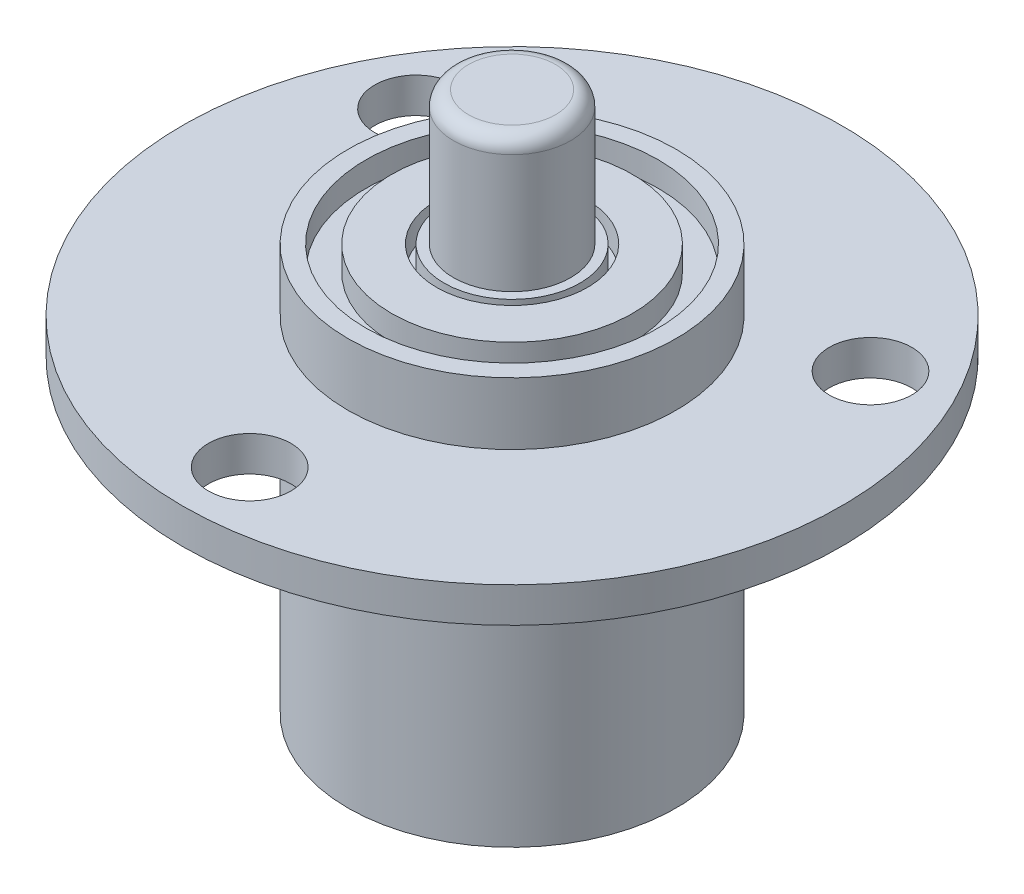
ISO-10303-21;
HEADER;
FILE_DESCRIPTION(('STEP AP214'),'2;1');
FILE_NAME('part.step','',(''),(''),'','','');
FILE_SCHEMA(('AUTOMOTIVE_DESIGN { 1 0 10303 214 1 1 1 1 }'));
ENDSEC;
DATA;
#1=APPLICATION_CONTEXT('core data for automotive mechanical design processes');
#2=APPLICATION_PROTOCOL_DEFINITION('international standard','automotive_design',2000,#1);
#3=PRODUCT_CONTEXT('',#1,'mechanical');
#4=PRODUCT('Part','Part','',(#3));
#5=PRODUCT_RELATED_PRODUCT_CATEGORY('part','',(#4));
#6=PRODUCT_DEFINITION_FORMATION('','',#4);
#7=PRODUCT_DEFINITION_CONTEXT('part definition',#1,'design');
#8=PRODUCT_DEFINITION('design','',#6,#7);
#9=PRODUCT_DEFINITION_SHAPE('','',#8);
#10=(LENGTH_UNIT() NAMED_UNIT(*) SI_UNIT(.MILLI.,.METRE.));
#11=(NAMED_UNIT(*) PLANE_ANGLE_UNIT() SI_UNIT($,.RADIAN.));
#12=(NAMED_UNIT(*) SI_UNIT($,.STERADIAN.) SOLID_ANGLE_UNIT());
#13=UNCERTAINTY_MEASURE_WITH_UNIT(LENGTH_MEASURE(1.E-05),#10,'distance_accuracy_value','');
#14=(GEOMETRIC_REPRESENTATION_CONTEXT(3) GLOBAL_UNCERTAINTY_ASSIGNED_CONTEXT((#13)) GLOBAL_UNIT_ASSIGNED_CONTEXT((#10,
#11,#12)) REPRESENTATION_CONTEXT('',''));
#15=CARTESIAN_POINT('',(0.,0.,0.));
#16=DIRECTION('',(0.,0.,1.));
#17=DIRECTION('',(1.,0.,0.));
#18=AXIS2_PLACEMENT_3D('',#15,#16,#17);
#19=CARTESIAN_POINT('',(0.,2.34,0.));
#20=DIRECTION('',(0.,-1.,0.));
#21=DIRECTION('',(0.,0.,-1.));
#22=AXIS2_PLACEMENT_3D('',#19,#20,#21);
#23=CYLINDRICAL_SURFACE('',#22,21.95);
#24=CARTESIAN_POINT('',(0.,2.34,0.));
#25=DIRECTION('',(0.,1.,0.));
#26=DIRECTION('',(0.,0.,1.));
#27=AXIS2_PLACEMENT_3D('',#24,#25,#26);
#28=CIRCLE('',#27,21.95);
#29=CARTESIAN_POINT('',(0.,2.34,21.95));
#30=VERTEX_POINT('',#29);
#31=EDGE_CURVE('E81',#30,#30,#28,.T.);
#32=ORIENTED_EDGE('',*,*,#31,.F.);
#33=EDGE_LOOP('',(#32));
#34=FACE_BOUND('',#33,.T.);
#35=CARTESIAN_POINT('',(0.,0.,0.));
#36=DIRECTION('',(0.,1.,0.));
#37=DIRECTION('',(0.,0.,1.));
#38=AXIS2_PLACEMENT_3D('',#35,#36,#37);
#39=CIRCLE('',#38,21.95);
#40=CARTESIAN_POINT('',(0.,0.,21.95));
#41=VERTEX_POINT('',#40);
#42=EDGE_CURVE('E76',#41,#41,#39,.T.);
#43=ORIENTED_EDGE('',*,*,#42,.T.);
#44=EDGE_LOOP('',(#43));
#45=FACE_BOUND('',#44,.T.);
#46=ADVANCED_FACE('F51',(#34,#45),#23,.T.);
#47=CARTESIAN_POINT('',(0.,2.34,0.));
#48=DIRECTION('',(0.,1.,0.));
#49=DIRECTION('',(0.,0.,1.));
#50=AXIS2_PLACEMENT_3D('',#47,#48,#49);
#51=PLANE('',#50);
#52=CARTESIAN_POINT('',(-15.133793931133,2.34,-8.73750000000007));
#53=DIRECTION('',(0.,1.,0.));
#54=DIRECTION('',(0.,0.,1.));
#55=AXIS2_PLACEMENT_3D('',#52,#53,#54);
#56=CIRCLE('',#55,2.75);
#57=CARTESIAN_POINT('',(-15.133793931133,2.34,-5.98750000000007));
#58=VERTEX_POINT('',#57);
#59=EDGE_CURVE('E103',#58,#58,#56,.T.);
#60=ORIENTED_EDGE('',*,*,#59,.F.);
#61=EDGE_LOOP('',(#60));
#62=FACE_BOUND('',#61,.T.);
#63=CARTESIAN_POINT('',(15.1337939311331,2.34,-8.73749999999986));
#64=DIRECTION('',(0.,1.,0.));
#65=DIRECTION('',(0.,0.,1.));
#66=AXIS2_PLACEMENT_3D('',#63,#64,#65);
#67=CIRCLE('',#66,2.75);
#68=CARTESIAN_POINT('',(15.1337939311331,2.34,-5.98749999999986));
#69=VERTEX_POINT('',#68);
#70=EDGE_CURVE('E107',#69,#69,#67,.T.);
#71=ORIENTED_EDGE('',*,*,#70,.F.);
#72=EDGE_LOOP('',(#71));
#73=FACE_BOUND('',#72,.T.);
#74=CARTESIAN_POINT('',(0.,2.34,17.475));
#75=DIRECTION('',(0.,1.,0.));
#76=DIRECTION('',(0.,0.,1.));
#77=AXIS2_PLACEMENT_3D('',#74,#75,#76);
#78=CIRCLE('',#77,2.75);
#79=CARTESIAN_POINT('',(0.,2.34,20.225));
#80=VERTEX_POINT('',#79);
#81=EDGE_CURVE('E95',#80,#80,#78,.T.);
#82=ORIENTED_EDGE('',*,*,#81,.F.);
#83=EDGE_LOOP('',(#82));
#84=FACE_BOUND('',#83,.T.);
#85=CARTESIAN_POINT('',(0.,2.33999999999999,0.));
#86=DIRECTION('',(0.,1.,0.));
#87=DIRECTION('',(0.,0.,1.));
#88=AXIS2_PLACEMENT_3D('',#85,#86,#87);
#89=CIRCLE('',#88,10.925);
#90=CARTESIAN_POINT('',(0.,2.33999999999999,10.925));
#91=VERTEX_POINT('',#90);
#92=EDGE_CURVE('E69',#91,#91,#89,.T.);
#93=ORIENTED_EDGE('',*,*,#92,.F.);
#94=EDGE_LOOP('',(#93));
#95=FACE_BOUND('',#94,.T.);
#96=ORIENTED_EDGE('',*,*,#31,.T.);
#97=EDGE_LOOP('',(#96));
#98=FACE_BOUND('',#97,.T.);
#99=ADVANCED_FACE('F192',(#62,#73,#84,#95,#98),#51,.T.);
#100=CARTESIAN_POINT('',(0.,0.,0.));
#101=DIRECTION('',(0.,1.,0.));
#102=DIRECTION('',(0.,0.,1.));
#103=AXIS2_PLACEMENT_3D('',#100,#101,#102);
#104=PLANE('',#103);
#105=CARTESIAN_POINT('',(-15.133793931133,0.,-8.73750000000007));
#106=DIRECTION('',(0.,-1.,0.));
#107=DIRECTION('',(0.866025403784436,0.,0.500000000000004));
#108=AXIS2_PLACEMENT_3D('',#105,#106,#107);
#109=CIRCLE('',#108,2.75);
#110=CARTESIAN_POINT('',(-12.7522240707258,0.,-7.36250000000006));
#111=VERTEX_POINT('',#110);
#112=EDGE_CURVE('E111',#111,#111,#109,.T.);
#113=ORIENTED_EDGE('',*,*,#112,.F.);
#114=EDGE_LOOP('',(#113));
#115=FACE_BOUND('',#114,.T.);
#116=CARTESIAN_POINT('',(15.1337939311331,0.,-8.73749999999986));
#117=DIRECTION('',(0.,-1.,0.));
#118=DIRECTION('',(-0.866025403784443,0.,0.499999999999992));
#119=AXIS2_PLACEMENT_3D('',#116,#117,#118);
#120=CIRCLE('',#119,2.75);
#121=CARTESIAN_POINT('',(12.7522240707259,0.,-7.36249999999988));
#122=VERTEX_POINT('',#121);
#123=EDGE_CURVE('E112',#122,#122,#120,.T.);
#124=ORIENTED_EDGE('',*,*,#123,.F.);
#125=EDGE_LOOP('',(#124));
#126=FACE_BOUND('',#125,.T.);
#127=CARTESIAN_POINT('',(0.,0.,17.475));
#128=DIRECTION('',(0.,-1.,0.));
#129=DIRECTION('',(0.,0.,-1.));
#130=AXIS2_PLACEMENT_3D('',#127,#128,#129);
#131=CIRCLE('',#130,2.75);
#132=CARTESIAN_POINT('',(0.,0.,14.725));
#133=VERTEX_POINT('',#132);
#134=EDGE_CURVE('E99',#133,#133,#131,.T.);
#135=ORIENTED_EDGE('',*,*,#134,.F.);
#136=EDGE_LOOP('',(#135));
#137=FACE_BOUND('',#136,.T.);
#138=CARTESIAN_POINT('',(0.,0.,0.));
#139=DIRECTION('',(0.,1.,0.));
#140=DIRECTION('',(0.,0.,1.));
#141=AXIS2_PLACEMENT_3D('',#138,#139,#140);
#142=CIRCLE('',#141,10.925);
#143=CARTESIAN_POINT('',(0.,0.,10.925));
#144=VERTEX_POINT('',#143);
#145=EDGE_CURVE('E72',#144,#144,#142,.T.);
#146=ORIENTED_EDGE('',*,*,#145,.T.);
#147=EDGE_LOOP('',(#146));
#148=FACE_BOUND('',#147,.T.);
#149=ORIENTED_EDGE('',*,*,#42,.F.);
#150=EDGE_LOOP('',(#149));
#151=FACE_BOUND('',#150,.T.);
#152=ADVANCED_FACE('F197',(#115,#126,#137,#148,#151),#104,.F.);
#153=CARTESIAN_POINT('',(0.,-20.6,0.));
#154=DIRECTION('',(0.,1.,0.));
#155=DIRECTION('',(0.,0.,1.));
#156=AXIS2_PLACEMENT_3D('',#153,#154,#155);
#157=PLANE('',#156);
#158=CARTESIAN_POINT('',(0.,-20.6,0.));
#159=DIRECTION('',(0.,1.,0.));
#160=DIRECTION('',(0.,0.,1.));
#161=AXIS2_PLACEMENT_3D('',#158,#159,#160);
#162=CIRCLE('',#161,10.925);
#163=CARTESIAN_POINT('',(0.,-20.6,10.925));
#164=VERTEX_POINT('',#163);
#165=EDGE_CURVE('E77',#164,#164,#162,.F.);
#166=ORIENTED_EDGE('',*,*,#165,.T.);
#167=EDGE_LOOP('',(#166));
#168=FACE_BOUND('',#167,.T.);
#169=ADVANCED_FACE('F204',(#168),#157,.F.);
#170=CARTESIAN_POINT('',(0.,-72.1005663378521,0.));
#171=DIRECTION('',(0.,1.,0.));
#172=DIRECTION('',(0.,0.,1.));
#173=AXIS2_PLACEMENT_3D('',#170,#171,#172);
#174=CYLINDRICAL_SURFACE('',#173,10.925);
#175=ORIENTED_EDGE('',*,*,#165,.F.);
#176=EDGE_LOOP('',(#175));
#177=FACE_BOUND('',#176,.T.);
#178=ORIENTED_EDGE('',*,*,#145,.F.);
#179=EDGE_LOOP('',(#178));
#180=FACE_BOUND('',#179,.T.);
#181=ADVANCED_FACE('F210',(#177,#180),#174,.T.);
#182=ORIENTED_EDGE('',*,*,#92,.T.);
#183=EDGE_LOOP('',(#182));
#184=FACE_BOUND('',#183,.T.);
#185=CARTESIAN_POINT('',(0.,6.48,0.));
#186=DIRECTION('',(0.,1.,0.));
#187=DIRECTION('',(0.,0.,1.));
#188=AXIS2_PLACEMENT_3D('',#185,#186,#187);
#189=CIRCLE('',#188,10.925);
#190=CARTESIAN_POINT('',(0.,6.48,10.925));
#191=VERTEX_POINT('',#190);
#192=EDGE_CURVE('E91',#191,#191,#189,.T.);
#193=ORIENTED_EDGE('',*,*,#192,.F.);
#194=EDGE_LOOP('',(#193));
#195=FACE_BOUND('',#194,.T.);
#196=ADVANCED_FACE('F207',(#184,#195),#174,.T.);
#197=CARTESIAN_POINT('',(0.,6.48,0.));
#198=DIRECTION('',(0.,1.,0.));
#199=DIRECTION('',(0.,0.,1.));
#200=AXIS2_PLACEMENT_3D('',#197,#198,#199);
#201=PLANE('',#200);
#202=CARTESIAN_POINT('',(0.,6.48,0.));
#203=DIRECTION('',(0.,1.,0.));
#204=DIRECTION('',(0.,0.,1.));
#205=AXIS2_PLACEMENT_3D('',#202,#203,#204);
#206=CIRCLE('',#205,9.725);
#207=CARTESIAN_POINT('',(0.,6.48,9.725));
#208=VERTEX_POINT('',#207);
#209=EDGE_CURVE('E120',#208,#208,#206,.T.);
#210=ORIENTED_EDGE('',*,*,#209,.F.);
#211=EDGE_LOOP('',(#210));
#212=FACE_BOUND('',#211,.T.);
#213=ORIENTED_EDGE('',*,*,#192,.T.);
#214=EDGE_LOOP('',(#213));
#215=FACE_BOUND('',#214,.T.);
#216=ADVANCED_FACE('F173',(#212,#215),#201,.T.);
#217=CARTESIAN_POINT('',(0.,6.48,17.475));
#218=DIRECTION('',(0.,-1.,0.));
#219=DIRECTION('',(0.,0.,-1.));
#220=AXIS2_PLACEMENT_3D('',#217,#218,#219);
#221=CYLINDRICAL_SURFACE('',#220,2.75);
#222=ORIENTED_EDGE('',*,*,#81,.T.);
#223=EDGE_LOOP('',(#222));
#224=FACE_BOUND('',#223,.T.);
#225=ORIENTED_EDGE('',*,*,#134,.T.);
#226=EDGE_LOOP('',(#225));
#227=FACE_BOUND('',#226,.T.);
#228=ADVANCED_FACE('F216',(#224,#227),#221,.F.);
#229=CARTESIAN_POINT('',(15.1337939311331,6.48,-8.73749999999986));
#230=DIRECTION('',(0.,-1.,0.));
#231=DIRECTION('',(0.,0.,-1.));
#232=AXIS2_PLACEMENT_3D('',#229,#230,#231);
#233=CYLINDRICAL_SURFACE('',#232,2.75);
#234=ORIENTED_EDGE('',*,*,#70,.T.);
#235=EDGE_LOOP('',(#234));
#236=FACE_BOUND('',#235,.T.);
#237=ORIENTED_EDGE('',*,*,#123,.T.);
#238=EDGE_LOOP('',(#237));
#239=FACE_BOUND('',#238,.T.);
#240=ADVANCED_FACE('F188',(#236,#239),#233,.F.);
#241=CARTESIAN_POINT('',(-15.133793931133,6.48,-8.73750000000007));
#242=DIRECTION('',(0.,-1.,0.));
#243=DIRECTION('',(0.,0.,-1.));
#244=AXIS2_PLACEMENT_3D('',#241,#242,#243);
#245=CYLINDRICAL_SURFACE('',#244,2.75);
#246=ORIENTED_EDGE('',*,*,#59,.T.);
#247=EDGE_LOOP('',(#246));
#248=FACE_BOUND('',#247,.T.);
#249=ORIENTED_EDGE('',*,*,#112,.T.);
#250=EDGE_LOOP('',(#249));
#251=FACE_BOUND('',#250,.T.);
#252=ADVANCED_FACE('F179',(#248,#251),#245,.F.);
#253=CARTESIAN_POINT('',(0.,4.83,0.));
#254=DIRECTION('',(0.,1.,0.));
#255=DIRECTION('',(0.,0.,1.));
#256=AXIS2_PLACEMENT_3D('',#253,#254,#255);
#257=CYLINDRICAL_SURFACE('',#256,8.025);
#258=CARTESIAN_POINT('',(0.,4.83,0.));
#259=DIRECTION('',(0.,1.,0.));
#260=DIRECTION('',(0.,0.,1.));
#261=AXIS2_PLACEMENT_3D('',#258,#259,#260);
#262=CIRCLE('',#261,8.025);
#263=CARTESIAN_POINT('',(0.,4.83,8.025));
#264=VERTEX_POINT('',#263);
#265=EDGE_CURVE('E124',#264,#264,#262,.T.);
#266=ORIENTED_EDGE('',*,*,#265,.T.);
#267=EDGE_LOOP('',(#266));
#268=FACE_BOUND('',#267,.T.);
#269=CARTESIAN_POINT('',(0.,6.48,0.));
#270=DIRECTION('',(0.,1.,0.));
#271=DIRECTION('',(0.,0.,1.));
#272=AXIS2_PLACEMENT_3D('',#269,#270,#271);
#273=CIRCLE('',#272,8.025);
#274=CARTESIAN_POINT('',(0.,6.48,8.025));
#275=VERTEX_POINT('',#274);
#276=EDGE_CURVE('E125',#275,#275,#273,.T.);
#277=ORIENTED_EDGE('',*,*,#276,.F.);
#278=EDGE_LOOP('',(#277));
#279=FACE_BOUND('',#278,.T.);
#280=ADVANCED_FACE('F176',(#268,#279),#257,.T.);
#281=CARTESIAN_POINT('',(0.,4.83,0.));
#282=DIRECTION('',(0.,1.,0.));
#283=DIRECTION('',(0.,0.,1.));
#284=AXIS2_PLACEMENT_3D('',#281,#282,#283);
#285=CYLINDRICAL_SURFACE('',#284,9.725);
#286=CARTESIAN_POINT('',(0.,4.83,0.));
#287=DIRECTION('',(0.,1.,0.));
#288=DIRECTION('',(0.,0.,1.));
#289=AXIS2_PLACEMENT_3D('',#286,#287,#288);
#290=CIRCLE('',#289,9.725);
#291=CARTESIAN_POINT('',(0.,4.83,9.725));
#292=VERTEX_POINT('',#291);
#293=EDGE_CURVE('E116',#292,#292,#290,.T.);
#294=ORIENTED_EDGE('',*,*,#293,.F.);
#295=EDGE_LOOP('',(#294));
#296=FACE_BOUND('',#295,.T.);
#297=ORIENTED_EDGE('',*,*,#209,.T.);
#298=EDGE_LOOP('',(#297));
#299=FACE_BOUND('',#298,.T.);
#300=ADVANCED_FACE('F178',(#296,#299),#285,.F.);
#301=CARTESIAN_POINT('',(0.,4.83,0.));
#302=DIRECTION('',(0.,1.,0.));
#303=DIRECTION('',(0.,0.,1.));
#304=AXIS2_PLACEMENT_3D('',#301,#302,#303);
#305=PLANE('',#304);
#306=ORIENTED_EDGE('',*,*,#265,.F.);
#307=EDGE_LOOP('',(#306));
#308=FACE_BOUND('',#307,.T.);
#309=ORIENTED_EDGE('',*,*,#293,.T.);
#310=EDGE_LOOP('',(#309));
#311=FACE_BOUND('',#310,.T.);
#312=ADVANCED_FACE('F171',(#308,#311),#305,.T.);
#313=CARTESIAN_POINT('',(0.,6.48,0.));
#314=DIRECTION('',(0.,1.,0.));
#315=DIRECTION('',(0.,0.,1.));
#316=AXIS2_PLACEMENT_3D('',#313,#314,#315);
#317=CIRCLE('',#316,5.025);
#318=CARTESIAN_POINT('',(0.,6.48,5.025));
#319=VERTEX_POINT('',#318);
#320=EDGE_CURVE('E136',#319,#319,#317,.T.);
#321=ORIENTED_EDGE('',*,*,#320,.F.);
#322=EDGE_LOOP('',(#321));
#323=FACE_BOUND('',#322,.T.);
#324=ORIENTED_EDGE('',*,*,#276,.T.);
#325=EDGE_LOOP('',(#324));
#326=FACE_BOUND('',#325,.T.);
#327=ADVANCED_FACE('F168',(#323,#326),#201,.T.);
#328=CARTESIAN_POINT('',(0.,4.83,0.));
#329=DIRECTION('',(0.,1.,0.));
#330=DIRECTION('',(0.,0.,1.));
#331=AXIS2_PLACEMENT_3D('',#328,#329,#330);
#332=CYLINDRICAL_SURFACE('',#331,4.525);
#333=CARTESIAN_POINT('',(0.,4.83,0.));
#334=DIRECTION('',(0.,1.,0.));
#335=DIRECTION('',(0.,0.,1.));
#336=AXIS2_PLACEMENT_3D('',#333,#334,#335);
#337=CIRCLE('',#336,4.525);
#338=CARTESIAN_POINT('',(0.,4.83,4.525));
#339=VERTEX_POINT('',#338);
#340=EDGE_CURVE('E140',#339,#339,#337,.T.);
#341=ORIENTED_EDGE('',*,*,#340,.T.);
#342=EDGE_LOOP('',(#341));
#343=FACE_BOUND('',#342,.T.);
#344=CARTESIAN_POINT('',(0.,6.48,0.));
#345=DIRECTION('',(0.,1.,0.));
#346=DIRECTION('',(0.,0.,1.));
#347=AXIS2_PLACEMENT_3D('',#344,#345,#346);
#348=CIRCLE('',#347,4.525);
#349=CARTESIAN_POINT('',(0.,6.48,4.525));
#350=VERTEX_POINT('',#349);
#351=EDGE_CURVE('E141',#350,#350,#348,.T.);
#352=ORIENTED_EDGE('',*,*,#351,.F.);
#353=EDGE_LOOP('',(#352));
#354=FACE_BOUND('',#353,.T.);
#355=ADVANCED_FACE('F152',(#343,#354),#332,.T.);
#356=CARTESIAN_POINT('',(0.,4.83,0.));
#357=DIRECTION('',(0.,1.,0.));
#358=DIRECTION('',(0.,0.,1.));
#359=AXIS2_PLACEMENT_3D('',#356,#357,#358);
#360=CYLINDRICAL_SURFACE('',#359,5.025);
#361=CARTESIAN_POINT('',(0.,4.83,0.));
#362=DIRECTION('',(0.,1.,0.));
#363=DIRECTION('',(0.,0.,1.));
#364=AXIS2_PLACEMENT_3D('',#361,#362,#363);
#365=CIRCLE('',#364,5.025);
#366=CARTESIAN_POINT('',(0.,4.83,5.025));
#367=VERTEX_POINT('',#366);
#368=EDGE_CURVE('E129',#367,#367,#365,.T.);
#369=ORIENTED_EDGE('',*,*,#368,.F.);
#370=EDGE_LOOP('',(#369));
#371=FACE_BOUND('',#370,.T.);
#372=ORIENTED_EDGE('',*,*,#320,.T.);
#373=EDGE_LOOP('',(#372));
#374=FACE_BOUND('',#373,.T.);
#375=ADVANCED_FACE('F159',(#371,#374),#360,.F.);
#376=CARTESIAN_POINT('',(0.,4.83,0.));
#377=DIRECTION('',(0.,1.,0.));
#378=DIRECTION('',(0.,0.,1.));
#379=AXIS2_PLACEMENT_3D('',#376,#377,#378);
#380=PLANE('',#379);
#381=ORIENTED_EDGE('',*,*,#340,.F.);
#382=EDGE_LOOP('',(#381));
#383=FACE_BOUND('',#382,.T.);
#384=ORIENTED_EDGE('',*,*,#368,.T.);
#385=EDGE_LOOP('',(#384));
#386=FACE_BOUND('',#385,.T.);
#387=ADVANCED_FACE('F155',(#383,#386),#380,.T.);
#388=CARTESIAN_POINT('',(0.,6.48,0.));
#389=DIRECTION('',(0.,1.,0.));
#390=DIRECTION('',(0.,0.,1.));
#391=AXIS2_PLACEMENT_3D('',#388,#389,#390);
#392=CIRCLE('',#391,3.9);
#393=CARTESIAN_POINT('',(0.,6.48,3.9));
#394=VERTEX_POINT('',#393);
#395=EDGE_CURVE('E64',#394,#394,#392,.T.);
#396=ORIENTED_EDGE('',*,*,#395,.F.);
#397=EDGE_LOOP('',(#396));
#398=FACE_BOUND('',#397,.T.);
#399=ORIENTED_EDGE('',*,*,#351,.T.);
#400=EDGE_LOOP('',(#399));
#401=FACE_BOUND('',#400,.T.);
#402=ADVANCED_FACE('F158',(#398,#401),#201,.T.);
#403=CARTESIAN_POINT('',(0.,15.38,0.));
#404=DIRECTION('',(0.,-1.,0.));
#405=DIRECTION('',(0.,0.,-1.));
#406=AXIS2_PLACEMENT_3D('',#403,#404,#405);
#407=CYLINDRICAL_SURFACE('',#406,3.9);
#408=CARTESIAN_POINT('',(0.,14.38,0.));
#409=DIRECTION('',(0.,1.,0.));
#410=DIRECTION('',(0.,0.,1.));
#411=AXIS2_PLACEMENT_3D('',#408,#409,#410);
#412=CIRCLE('',#411,3.9);
#413=CARTESIAN_POINT('',(0.,14.38,3.9));
#414=VERTEX_POINT('',#413);
#415=EDGE_CURVE('E12',#414,#414,#412,.F.);
#416=ORIENTED_EDGE('',*,*,#415,.T.);
#417=EDGE_LOOP('',(#416));
#418=FACE_BOUND('',#417,.T.);
#419=ORIENTED_EDGE('',*,*,#395,.T.);
#420=EDGE_LOOP('',(#419));
#421=FACE_BOUND('',#420,.T.);
#422=ADVANCED_FACE('F300',(#418,#421),#407,.T.);
#423=CARTESIAN_POINT('',(0.,15.38,0.));
#424=DIRECTION('',(0.,1.,0.));
#425=DIRECTION('',(0.,0.,1.));
#426=AXIS2_PLACEMENT_3D('',#423,#424,#425);
#427=PLANE('',#426);
#428=CARTESIAN_POINT('',(0.,15.38,0.));
#429=DIRECTION('',(0.,1.,0.));
#430=DIRECTION('',(0.,0.,1.));
#431=AXIS2_PLACEMENT_3D('',#428,#429,#430);
#432=CIRCLE('',#431,2.9);
#433=CARTESIAN_POINT('',(0.,15.38,2.9));
#434=VERTEX_POINT('',#433);
#435=EDGE_CURVE('E59',#434,#434,#432,.T.);
#436=ORIENTED_EDGE('',*,*,#435,.T.);
#437=EDGE_LOOP('',(#436));
#438=FACE_BOUND('',#437,.T.);
#439=ADVANCED_FACE('F341',(#438),#427,.T.);
#440=CARTESIAN_POINT('',(0.,14.38,0.));
#441=DIRECTION('',(0.,1.,0.));
#442=DIRECTION('',(0.,0.,1.));
#443=AXIS2_PLACEMENT_3D('',#440,#441,#442);
#444=TOROIDAL_SURFACE('',#443,2.9,1.);
#445=ORIENTED_EDGE('',*,*,#415,.F.);
#446=EDGE_LOOP('',(#445));
#447=FACE_BOUND('',#446,.T.);
#448=ORIENTED_EDGE('',*,*,#435,.F.);
#449=EDGE_LOOP('',(#448));
#450=FACE_BOUND('',#449,.T.);
#451=ADVANCED_FACE('F53',(#447,#450),#444,.T.);
#452=CLOSED_SHELL('',(#46,#99,#152,#169,#181,#196,#216,#228,#240,#252,#280,#300,#312,#327,#355,
#375,#387,#402,#422,#439,#451));
#453=MANIFOLD_SOLID_BREP('B2',#452);
#454=ADVANCED_BREP_SHAPE_REPRESENTATION('',(#18,#453),#14);
#455=SHAPE_DEFINITION_REPRESENTATION(#9,#454);
ENDSEC;
END-ISO-10303-21;
